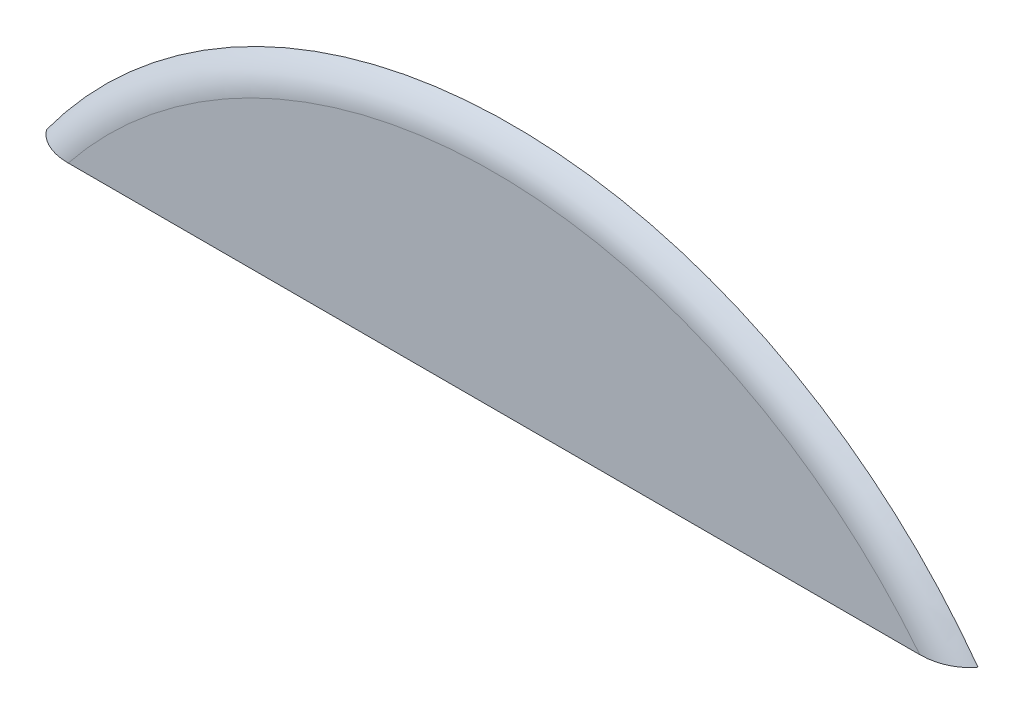
ISO-10303-21;
HEADER;
FILE_DESCRIPTION(('STEP AP214'),'2;1');
FILE_NAME('part.step','',(''),(''),'','','');
FILE_SCHEMA(('AUTOMOTIVE_DESIGN { 1 0 10303 214 1 1 1 1 }'));
ENDSEC;
DATA;
#1=APPLICATION_CONTEXT('core data for automotive mechanical design processes');
#2=APPLICATION_PROTOCOL_DEFINITION('international standard','automotive_design',2000,#1);
#3=PRODUCT_CONTEXT('',#1,'mechanical');
#4=PRODUCT('Part','Part','',(#3));
#5=PRODUCT_RELATED_PRODUCT_CATEGORY('part','',(#4));
#6=PRODUCT_DEFINITION_FORMATION('','',#4);
#7=PRODUCT_DEFINITION_CONTEXT('part definition',#1,'design');
#8=PRODUCT_DEFINITION('design','',#6,#7);
#9=PRODUCT_DEFINITION_SHAPE('','',#8);
#10=(LENGTH_UNIT() NAMED_UNIT(*) SI_UNIT(.MILLI.,.METRE.));
#11=(NAMED_UNIT(*) PLANE_ANGLE_UNIT() SI_UNIT($,.RADIAN.));
#12=(NAMED_UNIT(*) SI_UNIT($,.STERADIAN.) SOLID_ANGLE_UNIT());
#13=UNCERTAINTY_MEASURE_WITH_UNIT(LENGTH_MEASURE(1.E-05),#10,'distance_accuracy_value','');
#14=(GEOMETRIC_REPRESENTATION_CONTEXT(3) GLOBAL_UNCERTAINTY_ASSIGNED_CONTEXT((#13)) GLOBAL_UNIT_ASSIGNED_CONTEXT((#10,
#11,#12)) REPRESENTATION_CONTEXT('',''));
#15=CARTESIAN_POINT('',(0.,0.,0.));
#16=DIRECTION('',(0.,0.,1.));
#17=DIRECTION('',(1.,0.,0.));
#18=AXIS2_PLACEMENT_3D('',#15,#16,#17);
#19=CARTESIAN_POINT('',(-2.86663384918,1.856250000522,4.23035715523));
#20=DIRECTION('',(0.,-1.,0.));
#21=DIRECTION('',(-1.,0.,0.));
#22=AXIS2_PLACEMENT_3D('',#19,#20,#21);
#23=PLANE('',#22);
#24=CARTESIAN_POINT('',(2.36039476101115,1.85625000052201,4.23035715523));
#25=CARTESIAN_POINT('',(2.36650238960946,1.8562502985876,4.230357217724));
#26=CARTESIAN_POINT('',(2.37261028479625,1.85625565508507,4.23018615380603));
#27=CARTESIAN_POINT('',(2.38453782416111,1.85626964263865,4.22951285672645));
#28=CARTESIAN_POINT('',(2.39035831587637,1.85627811908451,4.22902554093137));
#29=CARTESIAN_POINT('',(2.40169493182325,1.85629231347302,4.22776083171756));
#30=CARTESIAN_POINT('',(2.40721266826,1.85629814098603,4.22699791737412));
#31=CARTESIAN_POINT('',(2.41793145937399,1.85630457225462,4.22522234263124));
#32=CARTESIAN_POINT('',(2.42313483161626,1.856305416975,4.22422368133304));
#33=CARTESIAN_POINT('',(2.43321631828777,1.85630191700728,4.22201562511434));
#34=CARTESIAN_POINT('',(2.43809738638191,1.85629783724775,4.22081972641645));
#35=CARTESIAN_POINT('',(2.44752896193653,1.85628711439748,4.21825444150218));
#36=CARTESIAN_POINT('',(2.45208299912876,1.85628062294425,4.21689804409823));
#37=CARTESIAN_POINT('',(2.46085818090248,1.85626872255364,4.2140472918077));
#38=CARTESIAN_POINT('',(2.46508337425425,1.85626327277149,4.21256540896762));
#39=CARTESIAN_POINT('',(2.47320087852802,1.85626179300069,4.20949611659246));
#40=CARTESIAN_POINT('',(2.47709772470504,1.85626520636619,4.20792073416485));
#41=CARTESIAN_POINT('',(2.48363772422679,1.85627864178563,4.20509648398337));
#42=CARTESIAN_POINT('',(2.48630115765258,1.85628633382031,4.20389434875609));
#43=CARTESIAN_POINT('',(2.49154740698779,1.85629980515331,4.20142248312842));
#44=CARTESIAN_POINT('',(2.4941308329347,1.85630561161104,4.20015404942839));
#45=CARTESIAN_POINT('',(2.49921531791681,1.85631650488634,4.19755270966983));
#46=CARTESIAN_POINT('',(2.50171703234749,1.85632160134485,4.1962210849979));
#47=CARTESIAN_POINT('',(2.50663678909447,1.85633042288018,4.19349698260291));
#48=CARTESIAN_POINT('',(2.50905552689339,1.85633416791199,4.19210576155091));
#49=CARTESIAN_POINT('',(2.51380809416422,1.85634023729948,4.1892659488382));
#50=CARTESIAN_POINT('',(2.51614265943154,1.85634258288562,4.18781858912779));
#51=CARTESIAN_POINT('',(2.52072580949373,1.85634576018416,4.18487000065546));
#52=CARTESIAN_POINT('',(2.52297516901805,1.8563466151185,4.1833699766248));
#53=CARTESIAN_POINT('',(2.52738697106713,1.85634683776387,4.180319529993));
#54=CARTESIAN_POINT('',(2.52955022613798,1.85634622883273,4.17877028305756));
#55=CARTESIAN_POINT('',(2.53378902191852,1.85634362190979,4.17562483433973));
#56=CARTESIAN_POINT('',(2.53586541162774,1.85634164625052,4.17402977713198));
#57=CARTESIAN_POINT('',(2.53992981335967,1.85633648273281,4.17079611540648));
#58=CARTESIAN_POINT('',(2.54191870934444,1.85633331486165,4.16915862238901));
#59=CARTESIAN_POINT('',(2.54580759118091,1.85632601518788,4.16584345511816));
#60=CARTESIAN_POINT('',(2.54770849429032,1.85632189978367,4.16416685729388));
#61=CARTESIAN_POINT('',(2.55142098497733,1.85631302119019,4.1607767990602));
#62=CARTESIAN_POINT('',(2.55323352125774,1.85630826959383,4.15906437801993));
#63=CARTESIAN_POINT('',(2.55676899575817,1.85629849843574,4.15560593972658));
#64=CARTESIAN_POINT('',(2.55849291207845,1.85629348449358,4.15386092279685));
#65=CARTESIAN_POINT('',(2.56185098386385,1.85628362727123,4.15034050065144));
#66=CARTESIAN_POINT('',(2.56348614454522,1.85627878254137,4.14856605476678));
#67=CARTESIAN_POINT('',(2.56666665430781,1.8562697598676,4.14498992439366));
#68=CARTESIAN_POINT('',(2.56821303325979,1.85626557233686,4.14318915625086));
#69=CARTESIAN_POINT('',(2.57121604926111,1.85625840350297,4.13956345163952));
#70=CARTESIAN_POINT('',(2.57267373791301,1.85625540365994,4.13773938685941));
#71=CARTESIAN_POINT('',(2.57549951287842,1.85625122603509,4.1340701381678));
#72=CARTESIAN_POINT('',(2.57686867007928,1.85625001944629,4.132225778672));
#73=CARTESIAN_POINT('',(2.57820400706504,1.856250000522,4.13035715374003));
#74=B_SPLINE_CURVE_WITH_KNOTS('',3,(#24,#25,#26,#27,#28,#29,#30,#31,#32,#33,#34,#35,#36,#37,#38,
#39,#40,#41,#42,#43,#44,#45,#46,#47,#48,#49,#50,#51,#52,#53,#54,#55,#56,#57,#58,#59,#60,#61,#62,
#63,#64,#65,#66,#67,#68,#69,#70,#71,#72,#73),.UNSPECIFIED.,.F.,.F.,(4,2,2,2,2,2,2,2,2,2,2,2,2,2,
2,2,2,2,2,2,2,2,2,2,4),(0.,0.01832083125341,0.0358347659588786,0.0525376055184254,
0.0684256216832801,0.0834956714392747,0.0977453150953962,0.111172945001451,0.123777935131626,
0.132542985724663,0.14117552258897,0.149676146171481,0.158045549374046,0.166284522691085,
0.17439395940386,0.182374860835005,0.190228341665308,0.197955635312344,0.205558099367577,
0.213037221084878,0.220394622909059,0.227632068027683,0.234751465923312,0.241754877896119,
0.248644522518785),.UNSPECIFIED.);
#75=CARTESIAN_POINT('',(2.360394761011,1.856250000522,4.23035715523));
#76=VERTEX_POINT('',#75);
#77=CARTESIAN_POINT('',(2.578204007065,1.856250000522,4.13035715374));
#78=VERTEX_POINT('',#77);
#79=EDGE_CURVE('E62',#76,#78,#74,.T.);
#80=ORIENTED_EDGE('',*,*,#79,.F.);
#81=DIRECTION('',(-1.,0.,0.));
#82=VECTOR('',#81,1.);
#83=CARTESIAN_POINT('',(-1.416696348777,1.856250000522,4.23035715523));
#84=LINE('',#83,#82);
#85=CARTESIAN_POINT('',(-2.293912457758,1.856250000522,4.23035715523));
#86=VERTEX_POINT('',#85);
#87=EDGE_CURVE('E29',#76,#86,#84,.T.);
#88=ORIENTED_EDGE('',*,*,#87,.T.);
#89=CARTESIAN_POINT('',(-2.51172170381229,1.856250000522,4.13035715374021));
#90=CARTESIAN_POINT('',(-2.51038659457448,1.85625001951566,4.13222545983491));
#91=CARTESIAN_POINT('',(-2.50901767331254,1.85625123291189,4.13406950628049));
#92=CARTESIAN_POINT('',(-2.5061923551053,1.85625543482019,4.13773818375332));
#93=CARTESIAN_POINT('',(-2.50473488587448,1.85625845235808,4.13956198929335));
#94=CARTESIAN_POINT('',(-2.50173229011053,1.85626566461605,4.14318722878723));
#95=CARTESIAN_POINT('',(-2.50018611062624,1.85626987803104,4.14498778994389));
#96=CARTESIAN_POINT('',(-2.49700597764265,1.85627895797847,4.14856355784456));
#97=CARTESIAN_POINT('',(-2.49537099297015,1.85628383419429,4.15033784709918));
#98=CARTESIAN_POINT('',(-2.49201324759572,1.85629375734868,4.15385800531952));
#99=CARTESIAN_POINT('',(-2.49028948042138,1.85629880577754,4.15560291377634));
#100=CARTESIAN_POINT('',(-2.48675427523445,1.85630864635573,4.15906118197759));
#101=CARTESIAN_POINT('',(-2.48494185791076,1.8563134328739,4.16077354018729));
#102=CARTESIAN_POINT('',(-2.48122957289683,1.85632237927774,4.16416351681752));
#103=CARTESIAN_POINT('',(-2.47932875533766,1.85632652751037,4.1658400946242));
#104=CARTESIAN_POINT('',(-2.47544000922554,1.85633388837605,4.16915526280622));
#105=CARTESIAN_POINT('',(-2.47345116229298,1.85633708450601,4.17079277547418));
#106=CARTESIAN_POINT('',(-2.4693868203005,1.85634229770717,4.17402651402166));
#107=CARTESIAN_POINT('',(-2.46731044020049,1.85634429464595,4.17562162708863));
#108=CARTESIAN_POINT('',(-2.46307162245236,1.85634693499438,4.17876722131119));
#109=CARTESIAN_POINT('',(-2.46090833477046,1.85634755589003,4.18031655654529));
#110=CARTESIAN_POINT('',(-2.45649642367744,1.85634734585055,4.18336720951443));
#111=CARTESIAN_POINT('',(-2.45424698672988,1.85634649134448,4.18486735020151));
#112=CARTESIAN_POINT('',(-2.44966363558099,1.85634330141679,4.18781619740183));
#113=CARTESIAN_POINT('',(-2.44732894570437,1.85634094253146,4.18926369776574));
#114=CARTESIAN_POINT('',(-2.4425760807493,1.85633483131479,4.19210381250323));
#115=CARTESIAN_POINT('',(-2.44015716897409,1.8563310574923,4.19349519347043));
#116=CARTESIAN_POINT('',(-2.43523701396972,1.85632216039695,4.19621963174476));
#117=CARTESIAN_POINT('',(-2.43273507440451,1.85631701687374,4.1975514308915));
#118=CARTESIAN_POINT('',(-2.42765008675275,1.85630601325964,4.20015312952248));
#119=CARTESIAN_POINT('',(-2.42506638245697,1.85630014327867,4.20142174607636));
#120=CARTESIAN_POINT('',(-2.41981952423211,1.85628651391372,4.20389398550079));
#121=CARTESIAN_POINT('',(-2.4171557595286,1.85627872688331,4.2050963101504));
#122=CARTESIAN_POINT('',(-2.41061651720422,1.85626508728851,4.207920300692));
#123=CARTESIAN_POINT('',(-2.40672078395092,1.85626157159837,4.20949529165305));
#124=CARTESIAN_POINT('',(-2.39860521706122,1.85626291181032,4.21256400208496));
#125=CARTESIAN_POINT('',(-2.39438084283188,1.85626832991325,4.21404568092008));
#126=CARTESIAN_POINT('',(-2.38560699658651,1.85628020038389,4.21689619995803));
#127=CARTESIAN_POINT('',(-2.38105347094096,1.85628669579436,4.21825255397239));
#128=CARTESIAN_POINT('',(-2.37162260026875,1.85629745126194,4.22081788860388));
#129=CARTESIAN_POINT('',(-2.36674172098632,1.85630156086052,4.22201386498985));
#130=CARTESIAN_POINT('',(-2.35666028183704,1.85630513015714,4.22422217075377));
#131=CARTESIAN_POINT('',(-2.35145676430585,1.85630432501212,4.22522098723131));
#132=CARTESIAN_POINT('',(-2.34073734416023,1.85629797120472,4.22699691774006));
#133=CARTESIAN_POINT('',(-2.33521912065931,1.85629218109971,4.22776001461963));
#134=CARTESIAN_POINT('',(-2.32388118881236,1.85627805030839,4.22902508019338));
#135=CARTESIAN_POINT('',(-2.31805986582598,1.85626959930854,4.22951255037351));
#136=CARTESIAN_POINT('',(-2.3061303248465,1.85625564679308,4.23018608816663));
#137=CARTESIAN_POINT('',(-2.30002125797112,1.85625029929005,4.23035721760159));
#138=CARTESIAN_POINT('',(-2.29391245775854,1.856250000522,4.23035715523));
#139=B_SPLINE_CURVE_WITH_KNOTS('',3,(#89,#90,#91,#92,#93,#94,#95,#96,#97,#98,#99,#100,#101,#102,
#103,#104,#105,#106,#107,#108,#109,#110,#111,#112,#113,#114,#115,#116,#117,#118,#119,#120,#121,
#122,#123,#124,#125,#126,#127,#128,#129,#130,#131,#132,#133,#134,#135,#136,#137,#138),
.UNSPECIFIED.,.F.,.F.,(4,2,2,2,2,2,2,2,2,2,2,2,2,2,2,2,2,2,2,2,2,2,2,2,4),(0.,
0.00688846918885288,0.0138908631614105,0.0210094006615399,0.0282461429658764,0.0356029993605274,
0.0430817326834827,0.0506839648946556,0.0584111826436578,0.0662647428125692,0.0742458780171242,
0.082355702055046,0.0905952152946261,0.0989653100003478,0.107466775595263,0.116100303862238,
0.124866494087931,0.137467951726544,0.150893061728015,0.165141198921915,0.180210754439124,
0.196099285716147,0.212803645510951,0.230320100222967,0.248644444980562),.UNSPECIFIED.);
#140=CARTESIAN_POINT('',(-2.511721703812,1.856250000522,4.13035715374));
#141=VERTEX_POINT('',#140);
#142=EDGE_CURVE('E59',#141,#86,#139,.T.);
#143=ORIENTED_EDGE('',*,*,#142,.F.);
#144=DIRECTION('',(1.,0.,0.));
#145=VECTOR('',#144,1.);
#146=CARTESIAN_POINT('',(2.801116151387,1.856250000522,4.13035715374));
#147=LINE('',#146,#145);
#148=EDGE_CURVE('E11',#141,#78,#147,.T.);
#149=ORIENTED_EDGE('',*,*,#148,.T.);
#150=EDGE_LOOP('',(#80,#88,#143,#149));
#151=FACE_BOUND('',#150,.T.);
#152=ADVANCED_FACE('F17',(#151),#23,.T.);
#153=CARTESIAN_POINT('',(-0.03275884889632,2.541000000591,4.13035715374));
#154=DIRECTION('',(0.,0.,1.));
#155=DIRECTION('',(1.,0.,0.));
#156=AXIS2_PLACEMENT_3D('',#153,#154,#155);
#157=PLANE('',#156);
#158=CARTESIAN_POINT('',(0.03324115162631,0.,4.13035715374));
#159=DIRECTION('',(0.,0.,-1.));
#160=DIRECTION('',(-1.,0.,0.));
#161=AXIS2_PLACEMENT_3D('',#158,#159,#160);
#162=CIRCLE('',#161,3.15);
#163=EDGE_CURVE('E67',#141,#78,#162,.T.);
#164=ORIENTED_EDGE('',*,*,#163,.T.);
#165=ORIENTED_EDGE('',*,*,#148,.F.);
#166=EDGE_LOOP('',(#164,#165));
#167=FACE_BOUND('',#166,.T.);
#168=ADVANCED_FACE('F90',(#167),#157,.F.);
#169=CARTESIAN_POINT('',(0.03324115162631,0.,4.23035715523));
#170=DIRECTION('',(0.,0.,1.));
#171=DIRECTION('',(1.,0.,0.));
#172=AXIS2_PLACEMENT_3D('',#169,#170,#171);
#173=PLANE('',#172);
#174=CARTESIAN_POINT('',(0.03324115162631,0.,4.23035715523));
#175=DIRECTION('',(0.,0.,-1.));
#176=DIRECTION('',(0.,-1.,0.));
#177=AXIS2_PLACEMENT_3D('',#174,#175,#176);
#178=CIRCLE('',#177,2.976794918383);
#179=EDGE_CURVE('E57',#86,#76,#178,.T.);
#180=ORIENTED_EDGE('',*,*,#179,.F.);
#181=ORIENTED_EDGE('',*,*,#87,.F.);
#182=EDGE_LOOP('',(#180,#181));
#183=FACE_BOUND('',#182,.T.);
#184=ADVANCED_FACE('F55',(#183),#173,.T.);
#185=CARTESIAN_POINT('',(0.03324115162631,0.,4.03035715523));
#186=DIRECTION('',(0.,0.,1.));
#187=DIRECTION('',(0.,1.,0.));
#188=AXIS2_PLACEMENT_3D('',#185,#186,#187);
#189=TOROIDAL_SURFACE('',#188,2.976794918383,0.2);
#190=ORIENTED_EDGE('',*,*,#179,.T.);
#191=ORIENTED_EDGE('',*,*,#79,.T.);
#192=ORIENTED_EDGE('',*,*,#163,.F.);
#193=ORIENTED_EDGE('',*,*,#142,.T.);
#194=EDGE_LOOP('',(#190,#191,#192,#193));
#195=FACE_BOUND('',#194,.T.);
#196=ADVANCED_FACE('F69',(#195),#189,.T.);
#197=CLOSED_SHELL('',(#152,#168,#184,#196));
#198=MANIFOLD_SOLID_BREP('B1',#197);
#199=ADVANCED_BREP_SHAPE_REPRESENTATION('',(#18,#198),#14);
#200=SHAPE_DEFINITION_REPRESENTATION(#9,#199);
ENDSEC;
END-ISO-10303-21;
